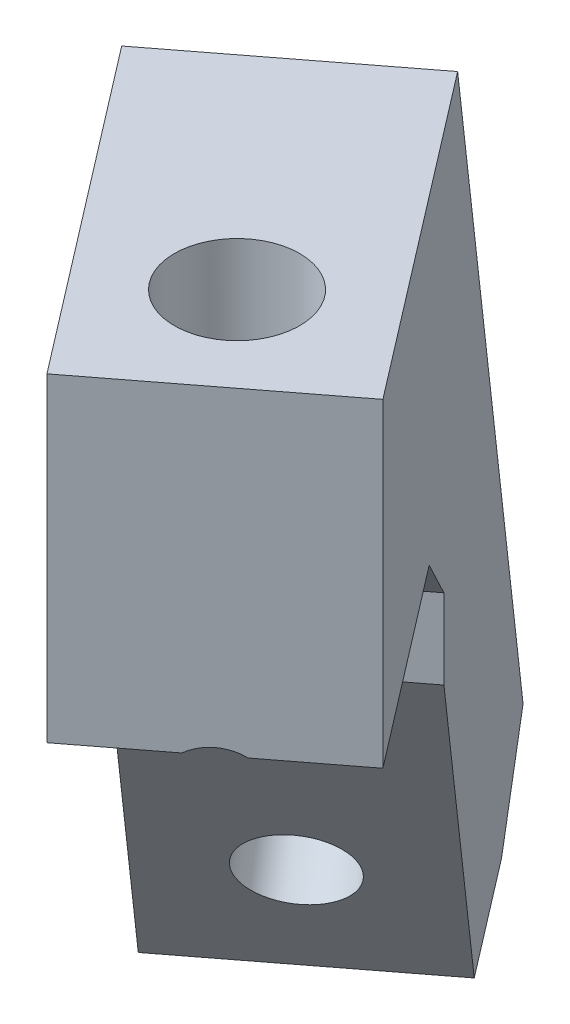
ISO-10303-21;
HEADER;
FILE_DESCRIPTION(('STEP AP214'),'2;1');
FILE_NAME('part.step','',(''),(''),'','','');
FILE_SCHEMA(('AUTOMOTIVE_DESIGN { 1 0 10303 214 1 1 1 1 }'));
ENDSEC;
DATA;
#1=APPLICATION_CONTEXT('core data for automotive mechanical design processes');
#2=APPLICATION_PROTOCOL_DEFINITION('international standard','automotive_design',2000,#1);
#3=PRODUCT_CONTEXT('',#1,'mechanical');
#4=PRODUCT('Part','Part','',(#3));
#5=PRODUCT_RELATED_PRODUCT_CATEGORY('part','',(#4));
#6=PRODUCT_DEFINITION_FORMATION('','',#4);
#7=PRODUCT_DEFINITION_CONTEXT('part definition',#1,'design');
#8=PRODUCT_DEFINITION('design','',#6,#7);
#9=PRODUCT_DEFINITION_SHAPE('','',#8);
#10=(LENGTH_UNIT() NAMED_UNIT(*) SI_UNIT(.MILLI.,.METRE.));
#11=(NAMED_UNIT(*) PLANE_ANGLE_UNIT() SI_UNIT($,.RADIAN.));
#12=(NAMED_UNIT(*) SI_UNIT($,.STERADIAN.) SOLID_ANGLE_UNIT());
#13=UNCERTAINTY_MEASURE_WITH_UNIT(LENGTH_MEASURE(1.E-05),#10,'distance_accuracy_value','');
#14=(GEOMETRIC_REPRESENTATION_CONTEXT(3) GLOBAL_UNCERTAINTY_ASSIGNED_CONTEXT((#13)) GLOBAL_UNIT_ASSIGNED_CONTEXT((#10,
#11,#12)) REPRESENTATION_CONTEXT('',''));
#15=CARTESIAN_POINT('',(0.,0.,0.));
#16=DIRECTION('',(0.,0.,1.));
#17=DIRECTION('',(1.,0.,0.));
#18=AXIS2_PLACEMENT_3D('',#15,#16,#17);
#19=CARTESIAN_POINT('',(-77.8987574197239,25.4,15.7518198388989));
#20=DIRECTION('',(-0.608761429008727,0.,-0.793353340291231));
#21=DIRECTION('',(-0.793353340291231,0.,0.608761429008727));
#22=AXIS2_PLACEMENT_3D('',#19,#20,#21);
#23=PLANE('',#22);
#24=DIRECTION('',(0.,-1.,0.));
#25=VECTOR('',#24,1.);
#26=CARTESIAN_POINT('',(-77.8987574197239,25.4,15.7518198388989));
#27=LINE('',#26,#25);
#28=CARTESIAN_POINT('',(-77.8987574197239,22.225,15.7518198388989));
#29=VERTEX_POINT('',#28);
#30=CARTESIAN_POINT('',(-77.8987574197238,19.05,15.7518198388989));
#31=VERTEX_POINT('',#30);
#32=EDGE_CURVE('E155',#29,#31,#27,.T.);
#33=ORIENTED_EDGE('',*,*,#32,.F.);
#34=DIRECTION('',(-0.793353340291231,0.,0.608761429008727));
#35=VECTOR('',#34,1.);
#36=CARTESIAN_POINT('',(-85.4554479859978,22.225,21.550272450207));
#37=LINE('',#36,#35);
#38=CARTESIAN_POINT('',(-85.4554479859978,22.225,21.550272450207));
#39=VERTEX_POINT('',#38);
#40=EDGE_CURVE('E196',#29,#39,#37,.T.);
#41=ORIENTED_EDGE('',*,*,#40,.T.);
#42=DIRECTION('',(0.,-1.,0.));
#43=VECTOR('',#42,1.);
#44=CARTESIAN_POINT('',(-85.4554479859978,25.4,21.550272450207));
#45=LINE('',#44,#43);
#46=CARTESIAN_POINT('',(-85.4554479859978,19.05,21.5502724502071));
#47=VERTEX_POINT('',#46);
#48=EDGE_CURVE('E169',#39,#47,#45,.T.);
#49=ORIENTED_EDGE('',*,*,#48,.T.);
#50=DIRECTION('',(-0.793353340291231,0.,0.608761429008727));
#51=VECTOR('',#50,1.);
#52=CARTESIAN_POINT('',(-77.8987574197238,19.05,15.7518198388989));
#53=LINE('',#52,#51);
#54=EDGE_CURVE('E193',#31,#47,#53,.T.);
#55=ORIENTED_EDGE('',*,*,#54,.F.);
#56=EDGE_LOOP('',(#33,#41,#49,#55));
#57=FACE_BOUND('',#56,.T.);
#58=ADVANCED_FACE('F36',(#57),#23,.F.);
#59=CARTESIAN_POINT('',(-77.8987574197238,19.05,15.7518198388989));
#60=DIRECTION('',(-0.556131238258942,0.406736643075795,-0.72476434032864));
#61=DIRECTION('',(-0.793353340291231,0.,0.608761429008727));
#62=AXIS2_PLACEMENT_3D('',#59,#60,#61);
#63=PLANE('',#62);
#64=CARTESIAN_POINT('',(-84.3562188917903,9.16534594457645,15.1595515109565));
#65=DIRECTION('',(-0.556131238258942,0.406736643075795,-0.72476434032864));
#66=DIRECTION('',(-0.793353340291231,0.,0.608761429008727));
#67=AXIS2_PLACEMENT_3D('',#64,#65,#66);
#68=CIRCLE('',#67,1.89865);
#69=CARTESIAN_POINT('',(-85.8625192113343,9.16534594457645,16.3153763981439));
#70=VERTEX_POINT('',#69);
#71=EDGE_CURVE('E276',#70,#70,#68,.T.);
#72=ORIENTED_EDGE('',*,*,#71,.T.);
#73=EDGE_LOOP('',(#72));
#74=FACE_BOUND('',#73,.T.);
#75=DIRECTION('',(-0.247605580069033,-0.913545457642603,-0.322685874403024));
#76=VECTOR('',#75,1.);
#77=CARTESIAN_POINT('',(-85.4554479859978,19.05,21.5502724502071));
#78=LINE('',#77,#76);
#79=CARTESIAN_POINT('',(-89.4296414101321,4.38713840617498,16.3710027432967));
#80=VERTEX_POINT('',#79);
#81=EDGE_CURVE('E171',#47,#80,#78,.T.);
#82=ORIENTED_EDGE('',*,*,#81,.T.);
#83=DIRECTION('',(0.79335334029123,0.,-0.608761429008727));
#84=VECTOR('',#83,1.);
#85=CARTESIAN_POINT('',(-131.673057014376,4.38713840617496,48.7855156008452));
#86=LINE('',#85,#84);
#87=CARTESIAN_POINT('',(-81.8729508438581,4.38713840617498,10.5725501319886));
#88=VERTEX_POINT('',#87);
#89=EDGE_CURVE('E270',#80,#88,#86,.T.);
#90=ORIENTED_EDGE('',*,*,#89,.T.);
#91=DIRECTION('',(-0.247605580069033,-0.913545457642603,-0.322685874403024));
#92=VECTOR('',#91,1.);
#93=CARTESIAN_POINT('',(-77.8987574197238,19.05,15.7518198388989));
#94=LINE('',#93,#92);
#95=EDGE_CURVE('E158',#31,#88,#94,.T.);
#96=ORIENTED_EDGE('',*,*,#95,.F.);
#97=ORIENTED_EDGE('',*,*,#54,.T.);
#98=EDGE_LOOP('',(#82,#90,#96,#97));
#99=FACE_BOUND('',#98,.T.);
#100=ADVANCED_FACE('F231',(#74,#99),#63,.F.);
#101=CARTESIAN_POINT('',(-85.9161620600716,15.1548810370458,5.30333468726298));
#102=DIRECTION('',(0.556131238258942,-0.406736643075795,0.72476434032864));
#103=DIRECTION('',(0.793353340291231,0.,-0.608761429008727));
#104=AXIS2_PLACEMENT_3D('',#101,#102,#103);
#105=PLANE('',#104);
#106=CARTESIAN_POINT('',(-90.1661947948174,13.4145769400275,7.58784349853575));
#107=DIRECTION('',(-0.556131238258943,0.406736643075795,-0.72476434032864));
#108=DIRECTION('',(-0.79335334029123,0.,0.608761429008727));
#109=AXIS2_PLACEMENT_3D('',#106,#107,#108);
#110=CIRCLE('',#109,1.89865);
#111=CARTESIAN_POINT('',(-91.6724951143614,13.4145769400275,8.74366838572317));
#112=VERTEX_POINT('',#111);
#113=EDGE_CURVE('E141',#112,#112,#110,.T.);
#114=ORIENTED_EDGE('',*,*,#113,.F.);
#115=EDGE_LOOP('',(#114));
#116=FACE_BOUND('',#115,.T.);
#117=CARTESIAN_POINT('',(-85.1348502937643,31.9778206393252,14.1448211462182));
#118=DIRECTION('',(-0.556131238258943,0.406736643075795,-0.72476434032864));
#119=DIRECTION('',(-0.79335334029123,0.,0.608761429008727));
#120=AXIS2_PLACEMENT_3D('',#117,#118,#119);
#121=CIRCLE('',#120,1.89865000000002);
#122=CARTESIAN_POINT('',(-86.6411506133083,31.9778206393252,15.3006460334057));
#123=VERTEX_POINT('',#122);
#124=EDGE_CURVE('E303',#123,#123,#121,.T.);
#125=ORIENTED_EDGE('',*,*,#124,.F.);
#126=EDGE_LOOP('',(#125));
#127=FACE_BOUND('',#126,.T.);
#128=DIRECTION('',(0.247605580069033,0.913545457642603,0.322685874403024));
#129=VECTOR('',#128,1.);
#130=CARTESIAN_POINT('',(-93.4728526263456,15.1548810370458,11.1017872985711));
#131=LINE('',#130,#129);
#132=CARTESIAN_POINT('',(-95.8312957765032,6.45336055300002,8.02820434488232));
#133=VERTEX_POINT('',#132);
#134=CARTESIAN_POINT('',(-87.2538523094529,38.1,19.2065463052531));
#135=VERTEX_POINT('',#134);
#136=EDGE_CURVE('E174',#133,#135,#131,.T.);
#137=ORIENTED_EDGE('',*,*,#136,.T.);
#138=DIRECTION('',(-0.793353340291231,0.,0.608761429008727));
#139=VECTOR('',#138,1.);
#140=CARTESIAN_POINT('',(-79.6971617431789,38.1,13.4080936939449));
#141=LINE('',#140,#139);
#142=CARTESIAN_POINT('',(-79.6971617431789,38.1,13.4080936939449));
#143=VERTEX_POINT('',#142);
#144=EDGE_CURVE('E190',#143,#135,#141,.T.);
#145=ORIENTED_EDGE('',*,*,#144,.F.);
#146=DIRECTION('',(0.247605580069033,0.913545457642603,0.322685874403024));
#147=VECTOR('',#146,1.);
#148=CARTESIAN_POINT('',(-85.9161620600716,15.1548810370458,5.30333468726298));
#149=LINE('',#148,#147);
#150=CARTESIAN_POINT('',(-88.2746052102292,6.45336055300002,2.22975173357421));
#151=VERTEX_POINT('',#150);
#152=EDGE_CURVE('E161',#151,#143,#149,.T.);
#153=ORIENTED_EDGE('',*,*,#152,.F.);
#154=DIRECTION('',(0.79335334029123,0.,-0.608761429008727));
#155=VECTOR('',#154,1.);
#156=CARTESIAN_POINT('',(-110.626160459016,6.45336055300001,19.3807032992715));
#157=LINE('',#156,#155);
#158=EDGE_CURVE('E144',#133,#151,#157,.T.);
#159=ORIENTED_EDGE('',*,*,#158,.F.);
#160=EDGE_LOOP('',(#137,#145,#153,#159));
#161=FACE_BOUND('',#160,.T.);
#162=ADVANCED_FACE('F236',(#116,#127,#161),#105,.F.);
#163=CARTESIAN_POINT('',(-72.7961191217727,38.1,22.40170753722));
#164=DIRECTION('',(0.,-1.,0.));
#165=DIRECTION('',(0.,0.,-1.));
#166=AXIS2_PLACEMENT_3D('',#163,#164,#165);
#167=PLANE('',#166);
#168=CARTESIAN_POINT('',(-76.5744644049097,38.1,25.300933842874));
#169=DIRECTION('',(0.,-1.,0.));
#170=DIRECTION('',(0.,0.,-1.));
#171=AXIS2_PLACEMENT_3D('',#168,#169,#170);
#172=CIRCLE('',#171,2.4892);
#173=CARTESIAN_POINT('',(-76.5744644049097,38.1,22.811733842874));
#174=VERTEX_POINT('',#173);
#175=EDGE_CURVE('E146',#174,#174,#172,.T.);
#176=ORIENTED_EDGE('',*,*,#175,.T.);
#177=EDGE_LOOP('',(#176));
#178=FACE_BOUND('',#177,.T.);
#179=DIRECTION('',(0.608761429008727,0.,0.79335334029123));
#180=VECTOR('',#179,1.);
#181=CARTESIAN_POINT('',(-80.3528096880467,38.1,28.2001601485281));
#182=LINE('',#181,#180);
#183=CARTESIAN_POINT('',(-77.4535833823926,38.1,31.9785054316651));
#184=VERTEX_POINT('',#183);
#185=EDGE_CURVE('E177',#135,#184,#182,.T.);
#186=ORIENTED_EDGE('',*,*,#185,.T.);
#187=DIRECTION('',(-0.793353340291231,0.,0.608761429008727));
#188=VECTOR('',#187,1.);
#189=CARTESIAN_POINT('',(-69.8968928161187,38.1,26.1800528203569));
#190=LINE('',#189,#188);
#191=CARTESIAN_POINT('',(-69.8968928161187,38.1,26.1800528203569));
#192=VERTEX_POINT('',#191);
#193=EDGE_CURVE('E187',#192,#184,#190,.T.);
#194=ORIENTED_EDGE('',*,*,#193,.F.);
#195=DIRECTION('',(0.608761429008727,0.,0.79335334029123));
#196=VECTOR('',#195,1.);
#197=CARTESIAN_POINT('',(-77.8987574197238,38.1,15.7518198388989));
#198=LINE('',#197,#196);
#199=EDGE_CURVE('E163',#143,#192,#198,.T.);
#200=ORIENTED_EDGE('',*,*,#199,.F.);
#201=ORIENTED_EDGE('',*,*,#144,.T.);
#202=EDGE_LOOP('',(#186,#194,#200,#201));
#203=FACE_BOUND('',#202,.T.);
#204=ADVANCED_FACE('F243',(#178,#203),#167,.F.);
#205=CARTESIAN_POINT('',(-69.8968928161187,38.1,26.1800528203569));
#206=DIRECTION('',(-0.608761429008727,0.,-0.793353340291231));
#207=DIRECTION('',(-0.793353340291231,0.,0.608761429008727));
#208=AXIS2_PLACEMENT_3D('',#205,#206,#207);
#209=PLANE('',#208);
#210=DIRECTION('',(-0.793353340291231,0.,0.608761429008727));
#211=VECTOR('',#210,1.);
#212=CARTESIAN_POINT('',(-69.8968928161187,25.4,26.1800528203569));
#213=LINE('',#212,#211);
#214=CARTESIAN_POINT('',(-74.4239939570846,25.4,29.6538197031305));
#215=VERTEX_POINT('',#214);
#216=CARTESIAN_POINT('',(-77.4535833823926,25.4,31.9785054316651));
#217=VERTEX_POINT('',#216);
#218=EDGE_CURVE('E168',#215,#217,#213,.T.);
#219=ORIENTED_EDGE('',*,*,#218,.F.);
#220=CARTESIAN_POINT('',(-73.6752378070685,23.5966257106241,29.0792789018079));
#221=DIRECTION('',(-0.608761429008727,0.,-0.793353340291231));
#222=DIRECTION('',(0.,1.,0.));
#223=AXIS2_PLACEMENT_3D('',#220,#221,#222);
#224=ELLIPSE('',#223,2.07833117018552,1.89865000000002);
#225=CARTESIAN_POINT('',(-72.9264816570523,25.4,28.5047381004853));
#226=VERTEX_POINT('',#225);
#227=EDGE_CURVE('E295',#215,#226,#224,.T.);
#228=ORIENTED_EDGE('',*,*,#227,.T.);
#229=CARTESIAN_POINT('',(-69.8968928161187,25.4,26.1800528203569));
#230=VERTEX_POINT('',#229);
#231=EDGE_CURVE('E184',#230,#226,#213,.T.);
#232=ORIENTED_EDGE('',*,*,#231,.F.);
#233=DIRECTION('',(0.,-1.,0.));
#234=VECTOR('',#233,1.);
#235=CARTESIAN_POINT('',(-69.8968928161187,38.1,26.1800528203569));
#236=LINE('',#235,#234);
#237=EDGE_CURVE('E165',#192,#230,#236,.T.);
#238=ORIENTED_EDGE('',*,*,#237,.F.);
#239=ORIENTED_EDGE('',*,*,#193,.T.);
#240=DIRECTION('',(0.,-1.,0.));
#241=VECTOR('',#240,1.);
#242=CARTESIAN_POINT('',(-77.4535833823926,38.1,31.9785054316651));
#243=LINE('',#242,#241);
#244=EDGE_CURVE('E179',#184,#217,#243,.T.);
#245=ORIENTED_EDGE('',*,*,#244,.T.);
#246=EDGE_LOOP('',(#219,#228,#232,#238,#239,#245));
#247=FACE_BOUND('',#246,.T.);
#248=ADVANCED_FACE('F247',(#247),#209,.F.);
#249=CARTESIAN_POINT('',(-69.8968928161187,25.4,26.1800528203569));
#250=DIRECTION('',(0.,1.,0.));
#251=DIRECTION('',(0.,0.,1.));
#252=AXIS2_PLACEMENT_3D('',#249,#250,#251);
#253=PLANE('',#252);
#254=CARTESIAN_POINT('',(-76.5744644049097,25.4,25.300933842874));
#255=DIRECTION('',(0.,-1.,0.));
#256=DIRECTION('',(0.,0.,-1.));
#257=AXIS2_PLACEMENT_3D('',#254,#255,#256);
#258=CIRCLE('',#257,2.4892);
#259=CARTESIAN_POINT('',(-77.0423661199311,25.4,27.745761981022));
#260=VERTEX_POINT('',#259);
#261=CARTESIAN_POINT('',(-78.9939189745586,25.4,24.7158216951577));
#262=VERTEX_POINT('',#261);
#263=EDGE_CURVE('E137',#260,#262,#258,.T.);
#264=ORIENTED_EDGE('',*,*,#263,.F.);
#265=CARTESIAN_POINT('',(-76.1409924757671,25.4,25.8658448543582));
#266=DIRECTION('',(0.,1.,0.));
#267=DIRECTION('',(-0.608761429008727,0.,-0.79335334029123));
#268=AXIS2_PLACEMENT_3D('',#265,#266,#267);
#269=ELLIPSE('',#268,4.66800823658813,1.89865000000002);
#270=EDGE_CURVE('E58',#260,#215,#269,.T.);
#271=ORIENTED_EDGE('',*,*,#270,.T.);
#272=ORIENTED_EDGE('',*,*,#218,.T.);
#273=DIRECTION('',(-0.608761429008727,0.,-0.79335334029123));
#274=VECTOR('',#273,1.);
#275=CARTESIAN_POINT('',(-77.4535833823926,25.4,31.9785054316651));
#276=LINE('',#275,#274);
#277=CARTESIAN_POINT('',(-83.5226304488952,25.4,24.0691693056316));
#278=VERTEX_POINT('',#277);
#279=EDGE_CURVE('E156',#217,#278,#276,.T.);
#280=ORIENTED_EDGE('',*,*,#279,.T.);
#281=DIRECTION('',(0.793353340291231,0.,-0.608761429008727));
#282=VECTOR('',#281,1.);
#283=CARTESIAN_POINT('',(-75.9659398826212,25.4,18.2707166943235));
#284=LINE('',#283,#282);
#285=CARTESIAN_POINT('',(-75.9659398826212,25.4,18.2707166943235));
#286=VERTEX_POINT('',#285);
#287=EDGE_CURVE('E199',#278,#286,#284,.T.);
#288=ORIENTED_EDGE('',*,*,#287,.T.);
#289=DIRECTION('',(-0.608761429008727,0.,-0.793353340291231));
#290=VECTOR('',#289,1.);
#291=CARTESIAN_POINT('',(-72.7961191217727,25.4,22.40170753722));
#292=LINE('',#291,#290);
#293=EDGE_CURVE('E152',#230,#286,#292,.T.);
#294=ORIENTED_EDGE('',*,*,#293,.F.);
#295=ORIENTED_EDGE('',*,*,#231,.T.);
#296=CARTESIAN_POINT('',(-74.0918398014925,25.4,25.4817423562463));
#297=VERTEX_POINT('',#296);
#298=EDGE_CURVE('E140',#226,#297,#269,.T.);
#299=ORIENTED_EDGE('',*,*,#298,.T.);
#300=CARTESIAN_POINT('',(-76.5134371953363,25.4,22.8124820511586));
#301=VERTEX_POINT('',#300);
#302=EDGE_CURVE('E139',#301,#297,#258,.T.);
#303=ORIENTED_EDGE('',*,*,#302,.F.);
#304=EDGE_CURVE('E64',#301,#262,#269,.T.);
#305=ORIENTED_EDGE('',*,*,#304,.T.);
#306=EDGE_LOOP('',(#264,#271,#272,#280,#288,#294,#295,#299,#303,#305));
#307=FACE_BOUND('',#306,.T.);
#308=ADVANCED_FACE('F136',(#307),#253,.F.);
#309=CARTESIAN_POINT('',(-56.6377645116068,0.,43.4596852485536));
#310=DIRECTION('',(-0.793353340291231,0.,0.608761429008727));
#311=DIRECTION('',(0.608761429008727,0.,0.793353340291231));
#312=AXIS2_PLACEMENT_3D('',#309,#310,#311);
#313=PLANE('',#312);
#314=ORIENTED_EDGE('',*,*,#95,.T.);
#315=DIRECTION('',(0.608761429008725,0.,0.793353340291232));
#316=VECTOR('',#315,1.);
#317=CARTESIAN_POINT('',(-81.8729508438581,4.38713840617498,10.5725501319886));
#318=LINE('',#317,#316);
#319=CARTESIAN_POINT('',(-85.4494585198738,4.38713840617498,5.91155458244369));
#320=VERTEX_POINT('',#319);
#321=EDGE_CURVE('E264',#320,#88,#318,.T.);
#322=ORIENTED_EDGE('',*,*,#321,.F.);
#323=DIRECTION('',(-0.556131238258942,0.406736643075796,-0.72476434032864));
#324=VECTOR('',#323,1.);
#325=CARTESIAN_POINT('',(-88.2746052102292,6.45336055300002,2.22975173357421));
#326=LINE('',#325,#324);
#327=EDGE_CURVE('E274',#320,#151,#326,.T.);
#328=ORIENTED_EDGE('',*,*,#327,.T.);
#329=ORIENTED_EDGE('',*,*,#152,.T.);
#330=ORIENTED_EDGE('',*,*,#199,.T.);
#331=ORIENTED_EDGE('',*,*,#237,.T.);
#332=ORIENTED_EDGE('',*,*,#293,.T.);
#333=DIRECTION('',(0.430459334576881,0.707106781186551,0.560985526796925));
#334=VECTOR('',#333,1.);
#335=CARTESIAN_POINT('',(-74.0331223455249,28.5749999999895,20.7896135497398));
#336=LINE('',#335,#334);
#337=EDGE_CURVE('E203',#286,#29,#336,.F.);
#338=ORIENTED_EDGE('',*,*,#337,.T.);
#339=ORIENTED_EDGE('',*,*,#32,.T.);
#340=EDGE_LOOP('',(#314,#322,#328,#329,#330,#331,#332,#338,#339));
#341=FACE_BOUND('',#340,.T.);
#342=ADVANCED_FACE('F254',(#341),#313,.F.);
#343=CARTESIAN_POINT('',(-64.1944550778808,0.,49.2581378598617));
#344=DIRECTION('',(-0.793353340291231,0.,0.608761429008727));
#345=DIRECTION('',(0.608761429008727,0.,0.793353340291231));
#346=AXIS2_PLACEMENT_3D('',#343,#344,#345);
#347=PLANE('',#346);
#348=DIRECTION('',(-0.608761429008727,0.,-0.793353340291231));
#349=VECTOR('',#348,1.);
#350=CARTESIAN_POINT('',(-64.1944550778808,4.38713840617499,49.2581378598617));
#351=LINE('',#350,#349);
#352=CARTESIAN_POINT('',(-93.0061490861477,4.38713840617497,11.7100071937518));
#353=VERTEX_POINT('',#352);
#354=EDGE_CURVE('E272',#80,#353,#351,.T.);
#355=ORIENTED_EDGE('',*,*,#354,.F.);
#356=ORIENTED_EDGE('',*,*,#81,.F.);
#357=ORIENTED_EDGE('',*,*,#48,.F.);
#358=DIRECTION('',(-0.430459334576881,-0.707106781186551,-0.560985526796925));
#359=VECTOR('',#358,1.);
#360=CARTESIAN_POINT('',(-85.4554479859978,22.225,21.550272450207));
#361=LINE('',#360,#359);
#362=EDGE_CURVE('E201',#39,#278,#361,.F.);
#363=ORIENTED_EDGE('',*,*,#362,.T.);
#364=ORIENTED_EDGE('',*,*,#279,.F.);
#365=ORIENTED_EDGE('',*,*,#244,.F.);
#366=ORIENTED_EDGE('',*,*,#185,.F.);
#367=ORIENTED_EDGE('',*,*,#136,.F.);
#368=DIRECTION('',(-0.556131238258942,0.406736643075796,-0.72476434032864));
#369=VECTOR('',#368,1.);
#370=CARTESIAN_POINT('',(-95.8312957765032,6.45336055300001,8.02820434488233));
#371=LINE('',#370,#369);
#372=EDGE_CURVE('E148',#353,#133,#371,.T.);
#373=ORIENTED_EDGE('',*,*,#372,.F.);
#374=EDGE_LOOP('',(#355,#356,#357,#363,#364,#365,#366,#367,#373));
#375=FACE_BOUND('',#374,.T.);
#376=ADVANCED_FACE('F255',(#375),#347,.T.);
#377=CARTESIAN_POINT('',(-76.5744644049097,38.1,25.300933842874));
#378=DIRECTION('',(0.,-1.,0.));
#379=DIRECTION('',(0.,0.,-1.));
#380=AXIS2_PLACEMENT_3D('',#377,#378,#379);
#381=CYLINDRICAL_SURFACE('',#380,2.4892);
#382=ORIENTED_EDGE('',*,*,#175,.F.);
#383=EDGE_LOOP('',(#382));
#384=FACE_BOUND('',#383,.T.);
#385=ORIENTED_EDGE('',*,*,#302,.T.);
#386=CARTESIAN_POINT('',(-74.0918398014925,25.4,25.4817423562463));
#387=CARTESIAN_POINT('',(-74.0928133653497,25.442713339057,25.4950355688633));
#388=CARTESIAN_POINT('',(-74.0940484660802,25.484685544502,25.5105987972117));
#389=CARTESIAN_POINT('',(-74.0972728872699,25.5667711277828,25.5457959434628));
#390=CARTESIAN_POINT('',(-74.0992608399412,25.6068877294503,25.5654224500255));
#391=CARTESIAN_POINT('',(-74.1041990515096,25.6846502095399,25.6081128667928));
#392=CARTESIAN_POINT('',(-74.1071394576334,25.7223168349662,25.6311403221378));
#393=CARTESIAN_POINT('',(-74.1142099033919,25.795485003627,25.6802535047784));
#394=CARTESIAN_POINT('',(-74.1183404409884,25.8309856330396,25.7063405095023));
#395=CARTESIAN_POINT('',(-74.1327706113762,25.9336736696117,25.7880386702453));
#396=CARTESIAN_POINT('',(-74.1451387368795,25.9976189444967,25.8474151279059));
#397=CARTESIAN_POINT('',(-74.1767539305325,26.1170025848197,25.9727254185245));
#398=CARTESIAN_POINT('',(-74.1960209070419,26.1724156596941,26.0386778264145));
#399=CARTESIAN_POINT('',(-74.2457710146132,26.2823929199197,26.1841262465581));
#400=CARTESIAN_POINT('',(-74.2774804761456,26.335653605624,26.2641943278227));
#401=CARTESIAN_POINT('',(-74.3520331267304,26.4313125910819,26.4255796680156));
#402=CARTESIAN_POINT('',(-74.3948739758019,26.4737131700738,26.5068966610281));
#403=CARTESIAN_POINT('',(-74.4963819543116,26.5507699731492,26.6750402943127));
#404=CARTESIAN_POINT('',(-74.5561283096798,26.5843822076851,26.7617020232025));
#405=CARTESIAN_POINT('',(-74.6886250092637,26.6378177844217,26.9291590748843));
#406=CARTESIAN_POINT('',(-74.7613723019442,26.6576443570164,27.0099557680532));
#407=CARTESIAN_POINT('',(-74.9137277069703,26.6822752934362,27.158004666671));
#408=CARTESIAN_POINT('',(-74.9927161512242,26.6878649547506,27.2257641551127));
#409=CARTESIAN_POINT('',(-75.158468702881,26.6861555030254,27.3507730437725));
#410=CARTESIAN_POINT('',(-75.2452311182245,26.6788591882709,27.4080247228588));
#411=CARTESIAN_POINT('',(-75.4201684818789,26.6521242442502,27.5085346838102));
#412=CARTESIAN_POINT('',(-75.508155368884,26.6331718256826,27.552252798755));
#413=CARTESIAN_POINT('',(-75.6858943674093,26.583977596296,27.6281424198463));
#414=CARTESIAN_POINT('',(-75.7756463628736,26.5537365253713,27.6603146824737));
#415=CARTESIAN_POINT('',(-75.9574071789893,26.4811023408652,27.7143692839081));
#416=CARTESIAN_POINT('',(-76.0493785492337,26.438305382758,27.7358324370068));
#417=CARTESIAN_POINT('',(-76.2292823764362,26.3412604774044,27.7677798772679));
#418=CARTESIAN_POINT('',(-76.3172073639018,26.286992311915,27.7782445823417));
#419=CARTESIAN_POINT('',(-76.4910276798855,26.1630040963909,27.7903546905651));
#420=CARTESIAN_POINT('',(-76.5764151010329,26.0925061638437,27.7913792312635));
#421=CARTESIAN_POINT('',(-76.7332926323834,25.9380306304288,27.7862916058872));
#422=CARTESIAN_POINT('',(-76.8048481480147,25.8541200772405,27.7802140352821));
#423=CARTESIAN_POINT('',(-76.9041943362594,25.7077492386947,27.768498322217));
#424=CARTESIAN_POINT('',(-76.9382274094599,25.6494710886174,27.7635921274812));
#425=CARTESIAN_POINT('',(-76.982538337328,25.5585277563796,27.7565024515615));
#426=CARTESIAN_POINT('',(-76.9962204713956,25.5275139962635,27.7541767123045));
#427=CARTESIAN_POINT('',(-77.0211549427852,25.4644745790811,27.7497586047492));
#428=CARTESIAN_POINT('',(-77.0324049039274,25.432447967175,27.7476664656291));
#429=CARTESIAN_POINT('',(-77.0423661199311,25.4,27.745761981022));
#430=B_SPLINE_CURVE_WITH_KNOTS('',3,(#386,#387,#388,#389,#390,#391,#392,#393,#394,#395,#396,
#397,#398,#399,#400,#401,#402,#403,#404,#405,#406,#407,#408,#409,#410,#411,#412,#413,#414,#415,
#416,#417,#418,#419,#420,#421,#422,#423,#424,#425,#426,#427,#428,#429),.UNSPECIFIED.,.F.,.F.,(4,
2,2,2,2,2,2,2,2,2,2,2,2,2,2,2,2,2,2,2,2,4),(0.,0.134130955722734,0.268019381248856,
0.400564792043434,0.533165741763883,0.796413321238322,1.06042677215396,1.36296101216985,
1.66543170643065,1.99519460819897,2.32488021056707,2.63594285619964,2.94693796057895,
3.24576602496819,3.54457450665387,3.85430703800692,4.16459010048484,4.4951449911308,
4.82409638714712,5.02637980268536,5.12821707029701,5.23015338553367),.UNSPECIFIED.);
#431=EDGE_CURVE('E11',#297,#260,#430,.T.);
#432=ORIENTED_EDGE('',*,*,#431,.T.);
#433=ORIENTED_EDGE('',*,*,#263,.T.);
#434=CARTESIAN_POINT('',(-78.9939189745586,25.4,24.7158216951577));
#435=CARTESIAN_POINT('',(-79.000805211298,25.4280099429769,24.7442841032548));
#436=CARTESIAN_POINT('',(-79.0069759577959,25.4569289175935,24.7720136694844));
#437=CARTESIAN_POINT('',(-79.0180296028694,25.5166610327573,24.825691640527));
#438=CARTESIAN_POINT('',(-79.0229111323495,25.5474761444608,24.8516381303341));
#439=CARTESIAN_POINT('',(-79.0358551986399,25.6430654566449,24.9264570813081));
#440=CARTESIAN_POINT('',(-79.0421594197139,25.7107398849103,24.9720543400355));
#441=CARTESIAN_POINT('',(-79.0514559802987,25.8536485246852,25.0514177412379));
#442=CARTESIAN_POINT('',(-79.0544237092831,25.9289345050677,25.0850947274714));
#443=CARTESIAN_POINT('',(-79.0584267284381,26.084329078665,25.1373675463382));
#444=CARTESIAN_POINT('',(-79.0594697777892,26.1644169581265,25.1560237615596));
#445=CARTESIAN_POINT('',(-79.0605981901312,26.3183414623821,25.1770586907397));
#446=CARTESIAN_POINT('',(-79.0607698012903,26.391990330358,25.1808938329087));
#447=CARTESIAN_POINT('',(-79.0606146373309,26.5391463331041,25.1777629205271));
#448=CARTESIAN_POINT('',(-79.0602867485219,26.6126527842078,25.1707727291199));
#449=CARTESIAN_POINT('',(-79.0590794932545,26.7474346683955,25.1496286278997));
#450=CARTESIAN_POINT('',(-79.0582887055444,26.8089134602477,25.1366849010509));
#451=CARTESIAN_POINT('',(-79.0560305493898,26.9305277939059,25.1055103094631));
#452=CARTESIAN_POINT('',(-79.0545627096539,26.9906623693906,25.0872757651066));
#453=CARTESIAN_POINT('',(-79.0507014164183,27.1095964997024,25.0463966695593));
#454=CARTESIAN_POINT('',(-79.0483047781027,27.1683907159011,25.0237370791433));
#455=CARTESIAN_POINT('',(-79.0423269937495,27.2843863580348,24.9747746599591));
#456=CARTESIAN_POINT('',(-79.0387454954129,27.341587304746,24.9484707489649));
#457=CARTESIAN_POINT('',(-79.0281944904343,27.4797681133223,24.8802261214208));
#458=CARTESIAN_POINT('',(-79.020425538109,27.559849025309,24.8365801078364));
#459=CARTESIAN_POINT('',(-79.0010136183273,27.7164281027424,24.7439602538766));
#460=CARTESIAN_POINT('',(-78.9893683104435,27.7929240717995,24.6949832068347));
#461=CARTESIAN_POINT('',(-78.9613513301589,27.9417312388146,24.5926275084059));
#462=CARTESIAN_POINT('',(-78.9449918189952,28.0140526369105,24.5392604319344));
#463=CARTESIAN_POINT('',(-78.9065569604912,28.153984354488,24.4286452023699));
#464=CARTESIAN_POINT('',(-78.8844866825651,28.2215987851032,24.3714005245036));
#465=CARTESIAN_POINT('',(-78.8309769787327,28.3574718622519,24.2477248640695));
#466=CARTESIAN_POINT('',(-78.7988307380546,28.425142768186,24.1809436448992));
#467=CARTESIAN_POINT('',(-78.7245638877305,28.5512613809551,24.0442634795697));
#468=CARTESIAN_POINT('',(-78.6824577387763,28.6097222566231,23.9743691715892));
#469=CARTESIAN_POINT('',(-78.5962639961933,28.7035542477647,23.8472873154775));
#470=CARTESIAN_POINT('',(-78.5542826918374,28.7412043696577,23.7903751202401));
#471=CARTESIAN_POINT('',(-78.4623966092934,28.8061779374003,23.677011306269));
#472=CARTESIAN_POINT('',(-78.4125028622412,28.833515583715,23.6205591596895));
#473=CARTESIAN_POINT('',(-78.3134949527761,28.87225998717,23.5187679099764));
#474=CARTESIAN_POINT('',(-78.2654708002887,28.8854853765205,23.4730678544757));
#475=CARTESIAN_POINT('',(-78.164917058438,28.9018714503479,23.3849391122908));
#476=CARTESIAN_POINT('',(-78.1123902540652,28.9050383107726,23.3425084338294));
#477=CARTESIAN_POINT('',(-78.0042934341044,28.9010321551204,23.2622481022425));
#478=CARTESIAN_POINT('',(-77.94872269892,28.8938566838405,23.2244195439426));
#479=CARTESIAN_POINT('',(-77.8362604787607,28.8697879368491,23.1542166836862));
#480=CARTESIAN_POINT('',(-77.7793680274888,28.8528873219454,23.1218465248562));
#481=CARTESIAN_POINT('',(-77.6506638406666,28.8049540589382,23.054942020431));
#482=CARTESIAN_POINT('',(-77.5789185054433,28.7713549588205,23.0221316439451));
#483=CARTESIAN_POINT('',(-77.4379288893748,28.6934534293225,22.9650478813735));
#484=CARTESIAN_POINT('',(-77.3686890525645,28.6491329596485,22.9407890554079));
#485=CARTESIAN_POINT('',(-77.2020585377034,28.5295112197311,22.8899140107522));
#486=CARTESIAN_POINT('',(-77.1067997862051,28.4494590352132,22.8675860450848));
#487=CARTESIAN_POINT('',(-76.9255337900837,28.2772073760016,22.8348875228678));
#488=CARTESIAN_POINT('',(-76.8395573555047,28.1849695787148,22.8245557405608));
#489=CARTESIAN_POINT('',(-76.7001040043558,28.0184055035177,22.8142170662866));
#490=CARTESIAN_POINT('',(-76.6442153986188,27.9461814150408,22.8121448210451));
#491=CARTESIAN_POINT('',(-76.5379699610853,27.7976837425757,22.8114339449129));
#492=CARTESIAN_POINT('',(-76.4876168702802,27.7214074710692,22.8127976213667));
#493=CARTESIAN_POINT('',(-76.3930648981059,27.5653331264892,22.8179021838591));
#494=CARTESIAN_POINT('',(-76.3488587252231,27.4855393765034,22.8216402235794));
#495=CARTESIAN_POINT('',(-76.2674598736112,27.3225800345807,22.8303998968682));
#496=CARTESIAN_POINT('',(-76.2302612556718,27.2394173712536,22.8354204348816));
#497=CARTESIAN_POINT('',(-76.1623864485378,27.0648144206336,22.8458264632233));
#498=CARTESIAN_POINT('',(-76.1322157442995,26.9731740518923,22.851216190456));
#499=CARTESIAN_POINT('',(-76.084189519504,26.786655446428,22.860368646656));
#500=CARTESIAN_POINT('',(-76.066309880566,26.6917839364452,22.8641345565432));
#501=CARTESIAN_POINT('',(-76.0485958070812,26.5181066082226,22.8679010482286));
#502=CARTESIAN_POINT('',(-76.0460114578023,26.4396152553178,22.8684742004097));
#503=CARTESIAN_POINT('',(-76.0537296232464,26.2833621015331,22.8668062185029));
#504=CARTESIAN_POINT('',(-76.0640032206919,26.205599058428,22.8645713994445));
#505=CARTESIAN_POINT('',(-76.0984411929144,26.0530022236259,22.8576123787011));
#506=CARTESIAN_POINT('',(-76.1226563438656,25.9781802132988,22.8528790826468));
#507=CARTESIAN_POINT('',(-76.1841211018417,25.8339275373414,22.8423352087538));
#508=CARTESIAN_POINT('',(-76.2214159311629,25.7645166112489,22.8365209266634));
#509=CARTESIAN_POINT('',(-76.2993640109863,25.6438482763442,22.8267281455695));
#510=CARTESIAN_POINT('',(-76.3383683409956,25.5915108025222,22.8226055976749));
#511=CARTESIAN_POINT('',(-76.4220093847739,25.4919992630708,22.8160479860375));
#512=CARTESIAN_POINT('',(-76.4666074531637,25.4447935643152,22.8136020249034));
#513=CARTESIAN_POINT('',(-76.5134371953363,25.4,22.8124820511586));
#514=B_SPLINE_CURVE_WITH_KNOTS('',3,(#434,#435,#436,#437,#438,#439,#440,#441,#442,#443,#444,
#445,#446,#447,#448,#449,#450,#451,#452,#453,#454,#455,#456,#457,#458,#459,#460,#461,#462,#463,
#464,#465,#466,#467,#468,#469,#470,#471,#472,#473,#474,#475,#476,#477,#478,#479,#480,#481,#482,
#483,#484,#485,#486,#487,#488,#489,#490,#491,#492,#493,#494,#495,#496,#497,#498,#499,#500,#501,
#502,#503,#504,#505,#506,#507,#508,#509,#510,#511,#512,#513),.UNSPECIFIED.,.F.,.F.,(4,2,2,2,2,2,
2,2,2,2,2,2,2,2,2,2,2,2,2,2,2,2,2,2,2,2,2,2,2,2,2,2,2,2,2,2,2,2,2,4),(0.,0.121522267279414,
0.243173071942282,0.487535967323155,0.733689735186106,0.978848968857831,1.19919393858296,
1.42003091135527,1.60825962711908,1.7966195658215,1.98563118147096,2.17469904724272,
2.4489583622038,2.72338356800027,2.99710708099183,3.27058843987527,3.57090359058481,
3.87078536443389,4.1102817410374,4.34944711238289,4.55134458598305,4.75311807032425,
4.95493946228008,5.15691336120511,5.41273636654981,5.66899286340303,6.04615831037654,
6.42453947304206,6.69826466966383,6.97217373154465,7.24575505723071,7.51910345713126,
7.80835768496148,8.09704268534606,8.33172593460319,8.56588233285185,8.80089699010402,
9.03673234149991,9.23247320814211,9.42692942709055),.UNSPECIFIED.);
#515=EDGE_CURVE('E51',#262,#301,#514,.T.);
#516=ORIENTED_EDGE('',*,*,#515,.T.);
#517=EDGE_LOOP('',(#385,#432,#433,#516));
#518=FACE_BOUND('',#517,.T.);
#519=ADVANCED_FACE('F143',(#384,#518),#381,.F.);
#520=CARTESIAN_POINT('',(-77.8987574197239,22.225,15.7518198388989));
#521=DIRECTION('',(0.430459334576886,-0.707106781186544,0.560985526796931));
#522=DIRECTION('',(0.793353340291231,0.,-0.608761429008727));
#523=AXIS2_PLACEMENT_3D('',#520,#521,#522);
#524=PLANE('',#523);
#525=ORIENTED_EDGE('',*,*,#337,.F.);
#526=ORIENTED_EDGE('',*,*,#287,.F.);
#527=ORIENTED_EDGE('',*,*,#362,.F.);
#528=ORIENTED_EDGE('',*,*,#40,.F.);
#529=EDGE_LOOP('',(#525,#526,#527,#528));
#530=FACE_BOUND('',#529,.T.);
#531=ADVANCED_FACE('F39',(#530),#524,.T.);
#532=CARTESIAN_POINT('',(-110.626160459016,6.45336055300001,19.3807032992715));
#533=DIRECTION('',(-0.247605580069034,-0.913545457642603,-0.322685874403024));
#534=DIRECTION('',(0.,0.333056962771193,-0.942906707765741));
#535=AXIS2_PLACEMENT_3D('',#532,#533,#534);
#536=PLANE('',#535);
#537=DIRECTION('',(0.79335334029123,0.,-0.608761429008727));
#538=VECTOR('',#537,1.);
#539=CARTESIAN_POINT('',(-107.801013768661,4.38713840617497,23.0625061481409));
#540=LINE('',#539,#538);
#541=EDGE_CURVE('E133',#353,#320,#540,.T.);
#542=ORIENTED_EDGE('',*,*,#541,.F.);
#543=ORIENTED_EDGE('',*,*,#372,.T.);
#544=ORIENTED_EDGE('',*,*,#158,.T.);
#545=ORIENTED_EDGE('',*,*,#327,.F.);
#546=EDGE_LOOP('',(#542,#543,#544,#545));
#547=FACE_BOUND('',#546,.T.);
#548=ADVANCED_FACE('F221',(#547),#536,.T.);
#549=CARTESIAN_POINT('',(-131.673057014376,4.38713840617496,48.7855156008452));
#550=DIRECTION('',(0.,1.,0.));
#551=DIRECTION('',(-1.,0.,0.));
#552=AXIS2_PLACEMENT_3D('',#549,#550,#551);
#553=PLANE('',#552);
#554=ORIENTED_EDGE('',*,*,#354,.T.);
#555=ORIENTED_EDGE('',*,*,#541,.T.);
#556=ORIENTED_EDGE('',*,*,#321,.T.);
#557=ORIENTED_EDGE('',*,*,#89,.F.);
#558=EDGE_LOOP('',(#554,#555,#556,#557));
#559=FACE_BOUND('',#558,.T.);
#560=ADVANCED_FACE('F218',(#559),#553,.F.);
#561=CARTESIAN_POINT('',(-71.0091168419872,21.6467099052,32.5538353905657));
#562=DIRECTION('',(-0.556131238258943,0.406736643075794,-0.72476434032864));
#563=DIRECTION('',(-0.79335334029123,0.,0.608761429008727));
#564=AXIS2_PLACEMENT_3D('',#561,#562,#563);
#565=CYLINDRICAL_SURFACE('',#564,1.89865000000002);
#566=ORIENTED_EDGE('',*,*,#124,.T.);
#567=EDGE_LOOP('',(#566));
#568=FACE_BOUND('',#567,.T.);
#569=ORIENTED_EDGE('',*,*,#515,.F.);
#570=ORIENTED_EDGE('',*,*,#304,.F.);
#571=EDGE_LOOP('',(#569,#570));
#572=FACE_BOUND('',#571,.T.);
#573=ADVANCED_FACE('F128',(#568,#572),#565,.F.);
#574=ORIENTED_EDGE('',*,*,#270,.F.);
#575=ORIENTED_EDGE('',*,*,#431,.F.);
#576=ORIENTED_EDGE('',*,*,#298,.F.);
#577=ORIENTED_EDGE('',*,*,#227,.F.);
#578=EDGE_LOOP('',(#574,#575,#576,#577));
#579=FACE_BOUND('',#578,.T.);
#580=ADVANCED_FACE('F212',(#579),#565,.F.);
#581=CARTESIAN_POINT('',(-76.0404613430403,3.08346620590237,25.9968577428832));
#582=DIRECTION('',(-0.556131238258943,0.406736643075794,-0.72476434032864));
#583=DIRECTION('',(-0.79335334029123,0.,0.608761429008727));
#584=AXIS2_PLACEMENT_3D('',#581,#582,#583);
#585=CYLINDRICAL_SURFACE('',#584,1.89865);
#586=ORIENTED_EDGE('',*,*,#113,.T.);
#587=EDGE_LOOP('',(#586));
#588=FACE_BOUND('',#587,.T.);
#589=ORIENTED_EDGE('',*,*,#71,.F.);
#590=EDGE_LOOP('',(#589));
#591=FACE_BOUND('',#590,.T.);
#592=ADVANCED_FACE('F217',(#588,#591),#585,.F.);
#593=CLOSED_SHELL('',(#58,#100,#162,#204,#248,#308,#342,#376,#519,#531,#548,#560,#573,#580,#592));
#594=MANIFOLD_SOLID_BREP('B2',#593);
#595=ADVANCED_BREP_SHAPE_REPRESENTATION('',(#18,#594),#14);
#596=SHAPE_DEFINITION_REPRESENTATION(#9,#595);
ENDSEC;
END-ISO-10303-21;
